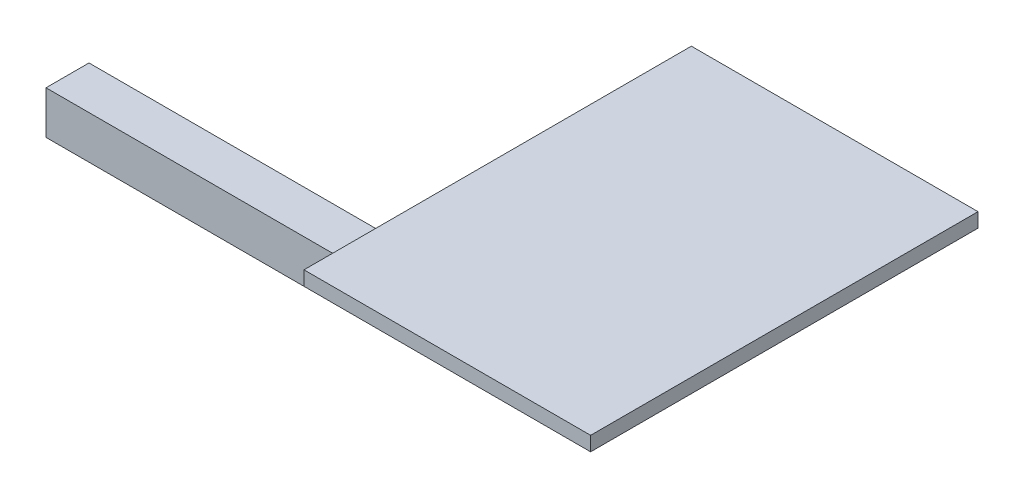
ISO-10303-21;
HEADER;
FILE_DESCRIPTION(('STEP AP214'),'2;1');
FILE_NAME('part.step','',(''),(''),'','','');
FILE_SCHEMA(('AUTOMOTIVE_DESIGN { 1 0 10303 214 1 1 1 1 }'));
ENDSEC;
DATA;
#1=APPLICATION_CONTEXT('core data for automotive mechanical design processes');
#2=APPLICATION_PROTOCOL_DEFINITION('international standard','automotive_design',2000,#1);
#3=PRODUCT_CONTEXT('',#1,'mechanical');
#4=PRODUCT('Part','Part','',(#3));
#5=PRODUCT_RELATED_PRODUCT_CATEGORY('part','',(#4));
#6=PRODUCT_DEFINITION_FORMATION('','',#4);
#7=PRODUCT_DEFINITION_CONTEXT('part definition',#1,'design');
#8=PRODUCT_DEFINITION('design','',#6,#7);
#9=PRODUCT_DEFINITION_SHAPE('','',#8);
#10=(LENGTH_UNIT() NAMED_UNIT(*) SI_UNIT(.MILLI.,.METRE.));
#11=(NAMED_UNIT(*) PLANE_ANGLE_UNIT() SI_UNIT($,.RADIAN.));
#12=(NAMED_UNIT(*) SI_UNIT($,.STERADIAN.) SOLID_ANGLE_UNIT());
#13=UNCERTAINTY_MEASURE_WITH_UNIT(LENGTH_MEASURE(1.E-05),#10,'distance_accuracy_value','');
#14=(GEOMETRIC_REPRESENTATION_CONTEXT(3) GLOBAL_UNCERTAINTY_ASSIGNED_CONTEXT((#13)) GLOBAL_UNIT_ASSIGNED_CONTEXT((#10,
#11,#12)) REPRESENTATION_CONTEXT('',''));
#15=CARTESIAN_POINT('',(0.,0.,0.));
#16=DIRECTION('',(0.,0.,1.));
#17=DIRECTION('',(1.,0.,0.));
#18=AXIS2_PLACEMENT_3D('',#15,#16,#17);
#19=CARTESIAN_POINT('',(-150.,-100.,-130.));
#20=DIRECTION('',(1.,0.,0.));
#21=DIRECTION('',(0.,0.,-1.));
#22=AXIS2_PLACEMENT_3D('',#19,#20,#21);
#23=PLANE('',#22);
#24=DIRECTION('',(0.,0.,-1.));
#25=VECTOR('',#24,1.);
#26=CARTESIAN_POINT('',(-150.,-70.,-130.));
#27=LINE('',#26,#25);
#28=CARTESIAN_POINT('',(-150.,-70.,-100.));
#29=VERTEX_POINT('',#28);
#30=CARTESIAN_POINT('',(-150.,-70.,-130.));
#31=VERTEX_POINT('',#30);
#32=EDGE_CURVE('E113',#29,#31,#27,.T.);
#33=ORIENTED_EDGE('',*,*,#32,.F.);
#34=DIRECTION('',(0.,1.,0.));
#35=VECTOR('',#34,1.);
#36=CARTESIAN_POINT('',(-150.,-100.,-100.));
#37=LINE('',#36,#35);
#38=CARTESIAN_POINT('',(-150.,0.,-100.));
#39=VERTEX_POINT('',#38);
#40=EDGE_CURVE('E123',#29,#39,#37,.T.);
#41=ORIENTED_EDGE('',*,*,#40,.T.);
#42=DIRECTION('',(0.,0.,-1.));
#43=VECTOR('',#42,1.);
#44=CARTESIAN_POINT('',(-150.,0.,-130.));
#45=LINE('',#44,#43);
#46=CARTESIAN_POINT('',(-150.,0.,-130.));
#47=VERTEX_POINT('',#46);
#48=EDGE_CURVE('E118',#39,#47,#45,.T.);
#49=ORIENTED_EDGE('',*,*,#48,.T.);
#50=DIRECTION('',(0.,1.,0.));
#51=VECTOR('',#50,1.);
#52=CARTESIAN_POINT('',(-150.,-100.,-130.));
#53=LINE('',#52,#51);
#54=EDGE_CURVE('E46',#31,#47,#53,.T.);
#55=ORIENTED_EDGE('',*,*,#54,.F.);
#56=EDGE_LOOP('',(#33,#41,#49,#55));
#57=FACE_BOUND('',#56,.T.);
#58=ADVANCED_FACE('F31',(#57),#23,.F.);
#59=CARTESIAN_POINT('',(0.,0.,-270.285174582183));
#60=DIRECTION('',(0.,1.,0.));
#61=DIRECTION('',(0.,0.,1.));
#62=AXIS2_PLACEMENT_3D('',#59,#60,#61);
#63=PLANE('',#62);
#64=DIRECTION('',(0.,0.,-1.));
#65=VECTOR('',#64,1.);
#66=CARTESIAN_POINT('',(0.,0.,0.));
#67=LINE('',#66,#65);
#68=CARTESIAN_POINT('',(0.,0.,0.));
#69=VERTEX_POINT('',#68);
#70=CARTESIAN_POINT('',(0.,0.,-270.285174582183));
#71=VERTEX_POINT('',#70);
#72=EDGE_CURVE('E143',#69,#71,#67,.T.);
#73=ORIENTED_EDGE('',*,*,#72,.F.);
#74=DIRECTION('',(1.,0.,0.));
#75=VECTOR('',#74,1.);
#76=CARTESIAN_POINT('',(0.,0.,0.));
#77=LINE('',#76,#75);
#78=CARTESIAN_POINT('',(-200.,0.,0.));
#79=VERTEX_POINT('',#78);
#80=EDGE_CURVE('E150',#79,#69,#77,.T.);
#81=ORIENTED_EDGE('',*,*,#80,.F.);
#82=DIRECTION('',(0.,0.,1.));
#83=VECTOR('',#82,1.);
#84=CARTESIAN_POINT('',(-200.,0.,0.));
#85=LINE('',#84,#83);
#86=CARTESIAN_POINT('',(-200.,0.,-270.285174582183));
#87=VERTEX_POINT('',#86);
#88=EDGE_CURVE('E148',#87,#79,#85,.T.);
#89=ORIENTED_EDGE('',*,*,#88,.F.);
#90=DIRECTION('',(-1.,0.,0.));
#91=VECTOR('',#90,1.);
#92=CARTESIAN_POINT('',(0.,0.,-270.285174582183));
#93=LINE('',#92,#91);
#94=EDGE_CURVE('E146',#71,#87,#93,.T.);
#95=ORIENTED_EDGE('',*,*,#94,.F.);
#96=EDGE_LOOP('',(#73,#81,#89,#95));
#97=FACE_BOUND('',#96,.T.);
#98=ORIENTED_EDGE('',*,*,#48,.F.);
#99=DIRECTION('',(-1.,0.,0.));
#100=VECTOR('',#99,1.);
#101=CARTESIAN_POINT('',(-150.,0.,-100.));
#102=LINE('',#101,#100);
#103=CARTESIAN_POINT('',(-120.,0.,-100.));
#104=VERTEX_POINT('',#103);
#105=EDGE_CURVE('E130',#104,#39,#102,.T.);
#106=ORIENTED_EDGE('',*,*,#105,.F.);
#107=DIRECTION('',(0.,0.,1.));
#108=VECTOR('',#107,1.);
#109=CARTESIAN_POINT('',(-120.,0.,-130.));
#110=LINE('',#109,#108);
#111=CARTESIAN_POINT('',(-120.,0.,-130.));
#112=VERTEX_POINT('',#111);
#113=EDGE_CURVE('E53',#112,#104,#110,.T.);
#114=ORIENTED_EDGE('',*,*,#113,.F.);
#115=DIRECTION('',(1.,0.,0.));
#116=VECTOR('',#115,1.);
#117=CARTESIAN_POINT('',(-150.,0.,-130.));
#118=LINE('',#117,#116);
#119=EDGE_CURVE('E319',#47,#112,#118,.T.);
#120=ORIENTED_EDGE('',*,*,#119,.F.);
#121=EDGE_LOOP('',(#98,#106,#114,#120));
#122=FACE_BOUND('',#121,.T.);
#123=ADVANCED_FACE('F177',(#97,#122),#63,.F.);
#124=CARTESIAN_POINT('',(0.,10.,0.));
#125=DIRECTION('',(-1.,0.,0.));
#126=DIRECTION('',(0.,0.,1.));
#127=AXIS2_PLACEMENT_3D('',#124,#125,#126);
#128=PLANE('',#127);
#129=ORIENTED_EDGE('',*,*,#72,.T.);
#130=DIRECTION('',(0.,-1.,0.));
#131=VECTOR('',#130,1.);
#132=CARTESIAN_POINT('',(0.,10.,-270.285174582183));
#133=LINE('',#132,#131);
#134=CARTESIAN_POINT('',(0.,10.,-270.285174582183));
#135=VERTEX_POINT('',#134);
#136=EDGE_CURVE('E11',#135,#71,#133,.T.);
#137=ORIENTED_EDGE('',*,*,#136,.F.);
#138=DIRECTION('',(0.,0.,-1.));
#139=VECTOR('',#138,1.);
#140=CARTESIAN_POINT('',(0.,10.,0.));
#141=LINE('',#140,#139);
#142=CARTESIAN_POINT('',(0.,10.,0.));
#143=VERTEX_POINT('',#142);
#144=EDGE_CURVE('E152',#143,#135,#141,.T.);
#145=ORIENTED_EDGE('',*,*,#144,.F.);
#146=DIRECTION('',(0.,-1.,0.));
#147=VECTOR('',#146,1.);
#148=CARTESIAN_POINT('',(0.,10.,0.));
#149=LINE('',#148,#147);
#150=EDGE_CURVE('E161',#143,#69,#149,.T.);
#151=ORIENTED_EDGE('',*,*,#150,.T.);
#152=EDGE_LOOP('',(#129,#137,#145,#151));
#153=FACE_BOUND('',#152,.T.);
#154=ADVANCED_FACE('F33',(#153),#128,.F.);
#155=CARTESIAN_POINT('',(0.,10.,-270.285174582183));
#156=DIRECTION('',(0.,0.,1.));
#157=DIRECTION('',(1.,0.,0.));
#158=AXIS2_PLACEMENT_3D('',#155,#156,#157);
#159=PLANE('',#158);
#160=ORIENTED_EDGE('',*,*,#94,.T.);
#161=DIRECTION('',(0.,-1.,0.));
#162=VECTOR('',#161,1.);
#163=CARTESIAN_POINT('',(-200.,10.,-270.285174582183));
#164=LINE('',#163,#162);
#165=CARTESIAN_POINT('',(-200.,10.,-270.285174582183));
#166=VERTEX_POINT('',#165);
#167=EDGE_CURVE('E39',#166,#87,#164,.T.);
#168=ORIENTED_EDGE('',*,*,#167,.F.);
#169=DIRECTION('',(-1.,0.,0.));
#170=VECTOR('',#169,1.);
#171=CARTESIAN_POINT('',(0.,10.,-270.285174582183));
#172=LINE('',#171,#170);
#173=EDGE_CURVE('E155',#135,#166,#172,.T.);
#174=ORIENTED_EDGE('',*,*,#173,.F.);
#175=ORIENTED_EDGE('',*,*,#136,.T.);
#176=EDGE_LOOP('',(#160,#168,#174,#175));
#177=FACE_BOUND('',#176,.T.);
#178=ADVANCED_FACE('F187',(#177),#159,.F.);
#179=CARTESIAN_POINT('',(-200.,10.,0.));
#180=DIRECTION('',(1.,0.,0.));
#181=DIRECTION('',(0.,0.,-1.));
#182=AXIS2_PLACEMENT_3D('',#179,#180,#181);
#183=PLANE('',#182);
#184=ORIENTED_EDGE('',*,*,#88,.T.);
#185=DIRECTION('',(0.,-1.,0.));
#186=VECTOR('',#185,1.);
#187=CARTESIAN_POINT('',(-200.,10.,0.));
#188=LINE('',#187,#186);
#189=CARTESIAN_POINT('',(-200.,10.,0.));
#190=VERTEX_POINT('',#189);
#191=EDGE_CURVE('E164',#190,#79,#188,.T.);
#192=ORIENTED_EDGE('',*,*,#191,.F.);
#193=DIRECTION('',(0.,0.,1.));
#194=VECTOR('',#193,1.);
#195=CARTESIAN_POINT('',(-200.,10.,0.));
#196=LINE('',#195,#194);
#197=EDGE_CURVE('E157',#166,#190,#196,.T.);
#198=ORIENTED_EDGE('',*,*,#197,.F.);
#199=ORIENTED_EDGE('',*,*,#167,.T.);
#200=EDGE_LOOP('',(#184,#192,#198,#199));
#201=FACE_BOUND('',#200,.T.);
#202=ADVANCED_FACE('F171',(#201),#183,.F.);
#203=CARTESIAN_POINT('',(0.,10.,0.));
#204=DIRECTION('',(0.,0.,-1.));
#205=DIRECTION('',(-1.,0.,0.));
#206=AXIS2_PLACEMENT_3D('',#203,#204,#205);
#207=PLANE('',#206);
#208=ORIENTED_EDGE('',*,*,#80,.T.);
#209=ORIENTED_EDGE('',*,*,#150,.F.);
#210=DIRECTION('',(1.,0.,0.));
#211=VECTOR('',#210,1.);
#212=CARTESIAN_POINT('',(0.,10.,0.));
#213=LINE('',#212,#211);
#214=EDGE_CURVE('E159',#190,#143,#213,.T.);
#215=ORIENTED_EDGE('',*,*,#214,.F.);
#216=ORIENTED_EDGE('',*,*,#191,.T.);
#217=EDGE_LOOP('',(#208,#209,#215,#216));
#218=FACE_BOUND('',#217,.T.);
#219=ADVANCED_FACE('F180',(#218),#207,.F.);
#220=CARTESIAN_POINT('',(0.,10.,-270.285174582183));
#221=DIRECTION('',(0.,1.,0.));
#222=DIRECTION('',(0.,0.,1.));
#223=AXIS2_PLACEMENT_3D('',#220,#221,#222);
#224=PLANE('',#223);
#225=ORIENTED_EDGE('',*,*,#144,.T.);
#226=ORIENTED_EDGE('',*,*,#173,.T.);
#227=ORIENTED_EDGE('',*,*,#197,.T.);
#228=ORIENTED_EDGE('',*,*,#214,.T.);
#229=EDGE_LOOP('',(#225,#226,#227,#228));
#230=FACE_BOUND('',#229,.T.);
#231=ADVANCED_FACE('F186',(#230),#224,.T.);
#232=CARTESIAN_POINT('',(-150.,-100.,-130.));
#233=DIRECTION('',(0.,0.,1.));
#234=DIRECTION('',(1.,0.,0.));
#235=AXIS2_PLACEMENT_3D('',#232,#233,#234);
#236=PLANE('',#235);
#237=ORIENTED_EDGE('',*,*,#119,.T.);
#238=DIRECTION('',(0.,1.,0.));
#239=VECTOR('',#238,1.);
#240=CARTESIAN_POINT('',(-120.,-100.,-130.));
#241=LINE('',#240,#239);
#242=CARTESIAN_POINT('',(-120.,-100.,-130.));
#243=VERTEX_POINT('',#242);
#244=EDGE_CURVE('E134',#243,#112,#241,.T.);
#245=ORIENTED_EDGE('',*,*,#244,.F.);
#246=DIRECTION('',(1.,0.,0.));
#247=VECTOR('',#246,1.);
#248=CARTESIAN_POINT('',(-150.,-100.,-130.));
#249=LINE('',#248,#247);
#250=CARTESIAN_POINT('',(-480.,-100.,-130.));
#251=VERTEX_POINT('',#250);
#252=EDGE_CURVE('E323',#251,#243,#249,.T.);
#253=ORIENTED_EDGE('',*,*,#252,.F.);
#254=DIRECTION('',(0.,-1.,0.));
#255=VECTOR('',#254,1.);
#256=CARTESIAN_POINT('',(-480.,-70.,-130.));
#257=LINE('',#256,#255);
#258=CARTESIAN_POINT('',(-480.,-70.,-130.));
#259=VERTEX_POINT('',#258);
#260=EDGE_CURVE('E125',#259,#251,#257,.T.);
#261=ORIENTED_EDGE('',*,*,#260,.F.);
#262=DIRECTION('',(1.,0.,0.));
#263=VECTOR('',#262,1.);
#264=CARTESIAN_POINT('',(-480.,-70.,-130.));
#265=LINE('',#264,#263);
#266=EDGE_CURVE('E119',#259,#31,#265,.T.);
#267=ORIENTED_EDGE('',*,*,#266,.T.);
#268=ORIENTED_EDGE('',*,*,#54,.T.);
#269=EDGE_LOOP('',(#237,#245,#253,#261,#267,#268));
#270=FACE_BOUND('',#269,.T.);
#271=ADVANCED_FACE('F201',(#270),#236,.F.);
#272=CARTESIAN_POINT('',(-120.,-100.,-130.));
#273=DIRECTION('',(-1.,0.,0.));
#274=DIRECTION('',(0.,0.,1.));
#275=AXIS2_PLACEMENT_3D('',#272,#273,#274);
#276=PLANE('',#275);
#277=ORIENTED_EDGE('',*,*,#113,.T.);
#278=DIRECTION('',(0.,1.,0.));
#279=VECTOR('',#278,1.);
#280=CARTESIAN_POINT('',(-120.,-100.,-100.));
#281=LINE('',#280,#279);
#282=CARTESIAN_POINT('',(-120.,-100.,-100.));
#283=VERTEX_POINT('',#282);
#284=EDGE_CURVE('E131',#283,#104,#281,.T.);
#285=ORIENTED_EDGE('',*,*,#284,.F.);
#286=DIRECTION('',(0.,0.,1.));
#287=VECTOR('',#286,1.);
#288=CARTESIAN_POINT('',(-120.,-100.,-130.));
#289=LINE('',#288,#287);
#290=EDGE_CURVE('E136',#243,#283,#289,.T.);
#291=ORIENTED_EDGE('',*,*,#290,.F.);
#292=ORIENTED_EDGE('',*,*,#244,.T.);
#293=EDGE_LOOP('',(#277,#285,#291,#292));
#294=FACE_BOUND('',#293,.T.);
#295=ADVANCED_FACE('F222',(#294),#276,.F.);
#296=CARTESIAN_POINT('',(-150.,-100.,-100.));
#297=DIRECTION('',(0.,0.,-1.));
#298=DIRECTION('',(-1.,0.,0.));
#299=AXIS2_PLACEMENT_3D('',#296,#297,#298);
#300=PLANE('',#299);
#301=ORIENTED_EDGE('',*,*,#105,.T.);
#302=ORIENTED_EDGE('',*,*,#40,.F.);
#303=DIRECTION('',(1.,0.,0.));
#304=VECTOR('',#303,1.);
#305=CARTESIAN_POINT('',(-480.,-70.,-100.));
#306=LINE('',#305,#304);
#307=CARTESIAN_POINT('',(-480.,-70.,-100.));
#308=VERTEX_POINT('',#307);
#309=EDGE_CURVE('E109',#308,#29,#306,.T.);
#310=ORIENTED_EDGE('',*,*,#309,.F.);
#311=DIRECTION('',(0.,1.,0.));
#312=VECTOR('',#311,1.);
#313=CARTESIAN_POINT('',(-480.,-70.,-100.));
#314=LINE('',#313,#312);
#315=CARTESIAN_POINT('',(-480.,-100.,-100.));
#316=VERTEX_POINT('',#315);
#317=EDGE_CURVE('E312',#316,#308,#314,.T.);
#318=ORIENTED_EDGE('',*,*,#317,.F.);
#319=DIRECTION('',(-1.,0.,0.));
#320=VECTOR('',#319,1.);
#321=CARTESIAN_POINT('',(-150.,-100.,-100.));
#322=LINE('',#321,#320);
#323=EDGE_CURVE('E132',#283,#316,#322,.T.);
#324=ORIENTED_EDGE('',*,*,#323,.F.);
#325=ORIENTED_EDGE('',*,*,#284,.T.);
#326=EDGE_LOOP('',(#301,#302,#310,#318,#324,#325));
#327=FACE_BOUND('',#326,.T.);
#328=ADVANCED_FACE('F128',(#327),#300,.F.);
#329=CARTESIAN_POINT('',(-150.,-100.,-100.));
#330=DIRECTION('',(0.,1.,0.));
#331=DIRECTION('',(0.,0.,1.));
#332=AXIS2_PLACEMENT_3D('',#329,#330,#331);
#333=PLANE('',#332);
#334=ORIENTED_EDGE('',*,*,#323,.T.);
#335=DIRECTION('',(0.,0.,1.));
#336=VECTOR('',#335,1.);
#337=CARTESIAN_POINT('',(-480.,-100.,-130.));
#338=LINE('',#337,#336);
#339=EDGE_CURVE('E310',#251,#316,#338,.T.);
#340=ORIENTED_EDGE('',*,*,#339,.F.);
#341=ORIENTED_EDGE('',*,*,#252,.T.);
#342=ORIENTED_EDGE('',*,*,#290,.T.);
#343=EDGE_LOOP('',(#334,#340,#341,#342));
#344=FACE_BOUND('',#343,.T.);
#345=ADVANCED_FACE('F234',(#344),#333,.F.);
#346=CARTESIAN_POINT('',(-480.,-70.,-130.));
#347=DIRECTION('',(0.,-1.,0.));
#348=DIRECTION('',(0.,0.,-1.));
#349=AXIS2_PLACEMENT_3D('',#346,#347,#348);
#350=PLANE('',#349);
#351=ORIENTED_EDGE('',*,*,#32,.T.);
#352=ORIENTED_EDGE('',*,*,#266,.F.);
#353=DIRECTION('',(0.,0.,-1.));
#354=VECTOR('',#353,1.);
#355=CARTESIAN_POINT('',(-480.,-70.,-130.));
#356=LINE('',#355,#354);
#357=EDGE_CURVE('E114',#308,#259,#356,.T.);
#358=ORIENTED_EDGE('',*,*,#357,.F.);
#359=ORIENTED_EDGE('',*,*,#309,.T.);
#360=EDGE_LOOP('',(#351,#352,#358,#359));
#361=FACE_BOUND('',#360,.T.);
#362=ADVANCED_FACE('F111',(#361),#350,.F.);
#363=CARTESIAN_POINT('',(-480.,-100.,-130.));
#364=DIRECTION('',(-1.,0.,0.));
#365=DIRECTION('',(0.,0.,1.));
#366=AXIS2_PLACEMENT_3D('',#363,#364,#365);
#367=PLANE('',#366);
#368=ORIENTED_EDGE('',*,*,#260,.T.);
#369=ORIENTED_EDGE('',*,*,#339,.T.);
#370=ORIENTED_EDGE('',*,*,#317,.T.);
#371=ORIENTED_EDGE('',*,*,#357,.T.);
#372=EDGE_LOOP('',(#368,#369,#370,#371));
#373=FACE_BOUND('',#372,.T.);
#374=ADVANCED_FACE('F248',(#373),#367,.T.);
#375=CLOSED_SHELL('',(#58,#123,#154,#178,#202,#219,#231,#271,#295,#328,#345,#362,#374));
#376=MANIFOLD_SOLID_BREP('B2',#375);
#377=ADVANCED_BREP_SHAPE_REPRESENTATION('',(#18,#376),#14);
#378=SHAPE_DEFINITION_REPRESENTATION(#9,#377);
ENDSEC;
END-ISO-10303-21;
